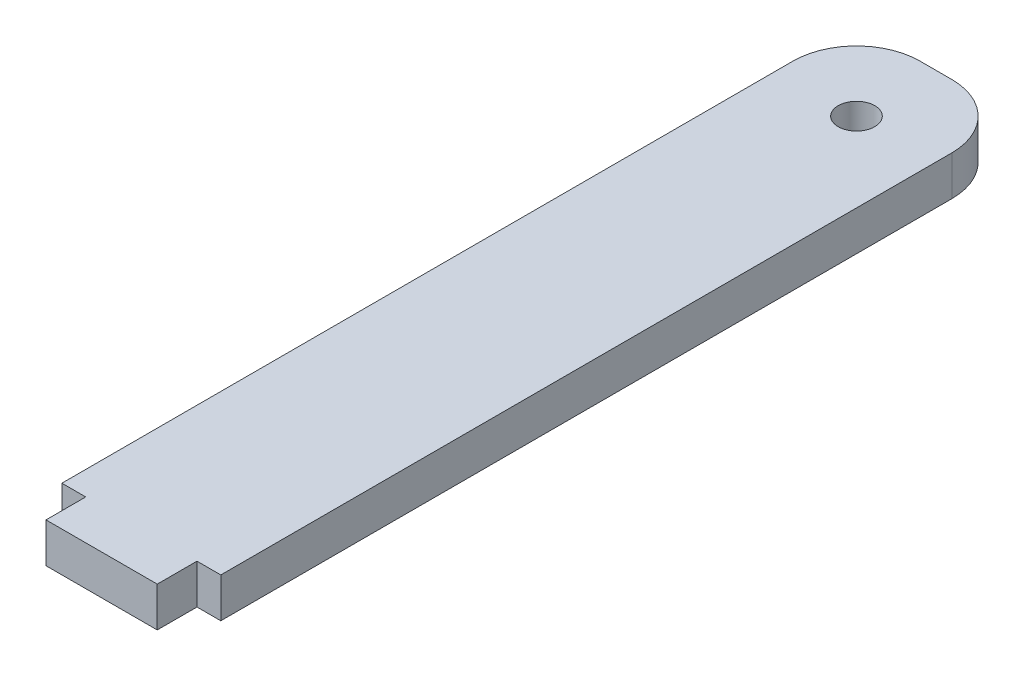
ISO-10303-21;
HEADER;
FILE_DESCRIPTION(('STEP AP214'),'2;1');
FILE_NAME('part.step','',(''),(''),'','','');
FILE_SCHEMA(('AUTOMOTIVE_DESIGN { 1 0 10303 214 1 1 1 1 }'));
ENDSEC;
DATA;
#1=APPLICATION_CONTEXT('core data for automotive mechanical design processes');
#2=APPLICATION_PROTOCOL_DEFINITION('international standard','automotive_design',2000,#1);
#3=PRODUCT_CONTEXT('',#1,'mechanical');
#4=PRODUCT('Part','Part','',(#3));
#5=PRODUCT_RELATED_PRODUCT_CATEGORY('part','',(#4));
#6=PRODUCT_DEFINITION_FORMATION('','',#4);
#7=PRODUCT_DEFINITION_CONTEXT('part definition',#1,'design');
#8=PRODUCT_DEFINITION('design','',#6,#7);
#9=PRODUCT_DEFINITION_SHAPE('','',#8);
#10=(LENGTH_UNIT() NAMED_UNIT(*) SI_UNIT(.MILLI.,.METRE.));
#11=(NAMED_UNIT(*) PLANE_ANGLE_UNIT() SI_UNIT($,.RADIAN.));
#12=(NAMED_UNIT(*) SI_UNIT($,.STERADIAN.) SOLID_ANGLE_UNIT());
#13=UNCERTAINTY_MEASURE_WITH_UNIT(LENGTH_MEASURE(1.E-05),#10,'distance_accuracy_value','');
#14=(GEOMETRIC_REPRESENTATION_CONTEXT(3) GLOBAL_UNCERTAINTY_ASSIGNED_CONTEXT((#13)) GLOBAL_UNIT_ASSIGNED_CONTEXT((#10,
#11,#12)) REPRESENTATION_CONTEXT('',''));
#15=CARTESIAN_POINT('',(0.,0.,0.));
#16=DIRECTION('',(0.,0.,1.));
#17=DIRECTION('',(1.,0.,0.));
#18=AXIS2_PLACEMENT_3D('',#15,#16,#17);
#19=CARTESIAN_POINT('',(0.,1.5875,-31.75));
#20=DIRECTION('',(0.,0.,1.));
#21=DIRECTION('',(1.,0.,0.));
#22=AXIS2_PLACEMENT_3D('',#19,#20,#21);
#23=PLANE('',#22);
#24=DIRECTION('',(-1.,0.,0.));
#25=VECTOR('',#24,1.);
#26=CARTESIAN_POINT('',(0.,1.5875,-31.75));
#27=LINE('',#26,#25);
#28=CARTESIAN_POINT('',(1.27,1.5875,-31.75));
#29=VERTEX_POINT('',#28);
#30=CARTESIAN_POINT('',(-1.27,1.5875,-31.75));
#31=VERTEX_POINT('',#30);
#32=EDGE_CURVE('E119',#29,#31,#27,.T.);
#33=ORIENTED_EDGE('',*,*,#32,.F.);
#34=DIRECTION('',(0.,-1.,0.));
#35=VECTOR('',#34,1.);
#36=CARTESIAN_POINT('',(1.27,-1.5875,-31.75));
#37=LINE('',#36,#35);
#38=CARTESIAN_POINT('',(1.27,-1.5875,-31.75));
#39=VERTEX_POINT('',#38);
#40=EDGE_CURVE('E184',#29,#39,#37,.T.);
#41=ORIENTED_EDGE('',*,*,#40,.T.);
#42=DIRECTION('',(-1.,0.,0.));
#43=VECTOR('',#42,1.);
#44=CARTESIAN_POINT('',(0.,-1.5875,-31.75));
#45=LINE('',#44,#43);
#46=CARTESIAN_POINT('',(-1.27,-1.5875,-31.75));
#47=VERTEX_POINT('',#46);
#48=EDGE_CURVE('E155',#39,#47,#45,.T.);
#49=ORIENTED_EDGE('',*,*,#48,.T.);
#50=DIRECTION('',(0.,-1.,0.));
#51=VECTOR('',#50,1.);
#52=CARTESIAN_POINT('',(-1.27,1.5875,-31.75));
#53=LINE('',#52,#51);
#54=EDGE_CURVE('E129',#47,#31,#53,.F.);
#55=ORIENTED_EDGE('',*,*,#54,.T.);
#56=EDGE_LOOP('',(#33,#41,#49,#55));
#57=FACE_BOUND('',#56,.T.);
#58=ADVANCED_FACE('F35',(#57),#23,.F.);
#59=CARTESIAN_POINT('',(-6.35,1.5875,0.));
#60=DIRECTION('',(1.,0.,0.));
#61=DIRECTION('',(0.,0.,-1.));
#62=AXIS2_PLACEMENT_3D('',#59,#60,#61);
#63=PLANE('',#62);
#64=DIRECTION('',(0.,0.,1.));
#65=VECTOR('',#64,1.);
#66=CARTESIAN_POINT('',(-6.35,1.5875,0.));
#67=LINE('',#66,#65);
#68=CARTESIAN_POINT('',(-6.35,1.5875,-26.67));
#69=VERTEX_POINT('',#68);
#70=CARTESIAN_POINT('',(-6.34999999999999,1.5875,31.75));
#71=VERTEX_POINT('',#70);
#72=EDGE_CURVE('E112',#69,#71,#67,.T.);
#73=ORIENTED_EDGE('',*,*,#72,.F.);
#74=DIRECTION('',(0.,-1.,0.));
#75=VECTOR('',#74,1.);
#76=CARTESIAN_POINT('',(-6.35,1.5875,-26.67));
#77=LINE('',#76,#75);
#78=CARTESIAN_POINT('',(-6.35,-1.5875,-26.67));
#79=VERTEX_POINT('',#78);
#80=EDGE_CURVE('E11',#69,#79,#77,.T.);
#81=ORIENTED_EDGE('',*,*,#80,.T.);
#82=DIRECTION('',(0.,0.,1.));
#83=VECTOR('',#82,1.);
#84=CARTESIAN_POINT('',(-6.35,-1.5875,0.));
#85=LINE('',#84,#83);
#86=CARTESIAN_POINT('',(-6.34999999999999,-1.5875,31.75));
#87=VERTEX_POINT('',#86);
#88=EDGE_CURVE('E125',#79,#87,#85,.T.);
#89=ORIENTED_EDGE('',*,*,#88,.T.);
#90=DIRECTION('',(0.,-1.,0.));
#91=VECTOR('',#90,1.);
#92=CARTESIAN_POINT('',(-6.34999999999999,1.5875,31.75));
#93=LINE('',#92,#91);
#94=EDGE_CURVE('E122',#71,#87,#93,.T.);
#95=ORIENTED_EDGE('',*,*,#94,.F.);
#96=EDGE_LOOP('',(#73,#81,#89,#95));
#97=FACE_BOUND('',#96,.T.);
#98=ADVANCED_FACE('F123',(#97),#63,.F.);
#99=CARTESIAN_POINT('',(0.,1.5875,31.75));
#100=DIRECTION('',(0.,0.,1.));
#101=DIRECTION('',(1.,0.,0.));
#102=AXIS2_PLACEMENT_3D('',#99,#100,#101);
#103=PLANE('',#102);
#104=DIRECTION('',(-1.,0.,0.));
#105=VECTOR('',#104,1.);
#106=CARTESIAN_POINT('',(0.,-1.5875,31.75));
#107=LINE('',#106,#105);
#108=CARTESIAN_POINT('',(-4.44499999999999,-1.5875,31.75));
#109=VERTEX_POINT('',#108);
#110=EDGE_CURVE('E159',#109,#87,#107,.T.);
#111=ORIENTED_EDGE('',*,*,#110,.F.);
#112=DIRECTION('',(0.,-1.,0.));
#113=VECTOR('',#112,1.);
#114=CARTESIAN_POINT('',(-4.44499999999999,1.5875,31.75));
#115=LINE('',#114,#113);
#116=CARTESIAN_POINT('',(-4.44499999999999,1.5875,31.75));
#117=VERTEX_POINT('',#116);
#118=EDGE_CURVE('E130',#117,#109,#115,.T.);
#119=ORIENTED_EDGE('',*,*,#118,.F.);
#120=DIRECTION('',(-1.,0.,0.));
#121=VECTOR('',#120,1.);
#122=CARTESIAN_POINT('',(0.,1.5875,31.75));
#123=LINE('',#122,#121);
#124=EDGE_CURVE('E116',#117,#71,#123,.T.);
#125=ORIENTED_EDGE('',*,*,#124,.T.);
#126=ORIENTED_EDGE('',*,*,#94,.T.);
#127=EDGE_LOOP('',(#111,#119,#125,#126));
#128=FACE_BOUND('',#127,.T.);
#129=ADVANCED_FACE('F132',(#128),#103,.T.);
#130=CARTESIAN_POINT('',(-4.44499999999999,1.5875,0.));
#131=DIRECTION('',(1.,0.,0.));
#132=DIRECTION('',(0.,0.,-1.));
#133=AXIS2_PLACEMENT_3D('',#130,#131,#132);
#134=PLANE('',#133);
#135=DIRECTION('',(0.,0.,1.));
#136=VECTOR('',#135,1.);
#137=CARTESIAN_POINT('',(-4.44499999999999,-1.5875,0.));
#138=LINE('',#137,#136);
#139=CARTESIAN_POINT('',(-4.44499999999999,-1.5875,34.925));
#140=VERTEX_POINT('',#139);
#141=EDGE_CURVE('E161',#109,#140,#138,.T.);
#142=ORIENTED_EDGE('',*,*,#141,.T.);
#143=DIRECTION('',(0.,-1.,0.));
#144=VECTOR('',#143,1.);
#145=CARTESIAN_POINT('',(-4.44499999999999,1.5875,34.925));
#146=LINE('',#145,#144);
#147=CARTESIAN_POINT('',(-4.44499999999999,1.5875,34.925));
#148=VERTEX_POINT('',#147);
#149=EDGE_CURVE('E179',#148,#140,#146,.T.);
#150=ORIENTED_EDGE('',*,*,#149,.F.);
#151=DIRECTION('',(0.,0.,1.));
#152=VECTOR('',#151,1.);
#153=CARTESIAN_POINT('',(-4.44499999999999,1.5875,0.));
#154=LINE('',#153,#152);
#155=EDGE_CURVE('E134',#117,#148,#154,.T.);
#156=ORIENTED_EDGE('',*,*,#155,.F.);
#157=ORIENTED_EDGE('',*,*,#118,.T.);
#158=EDGE_LOOP('',(#142,#150,#156,#157));
#159=FACE_BOUND('',#158,.T.);
#160=ADVANCED_FACE('F218',(#159),#134,.F.);
#161=CARTESIAN_POINT('',(0.,1.5875,34.925));
#162=DIRECTION('',(0.,0.,-1.));
#163=DIRECTION('',(-1.,0.,0.));
#164=AXIS2_PLACEMENT_3D('',#161,#162,#163);
#165=PLANE('',#164);
#166=DIRECTION('',(1.,0.,0.));
#167=VECTOR('',#166,1.);
#168=CARTESIAN_POINT('',(0.,-1.5875,34.925));
#169=LINE('',#168,#167);
#170=CARTESIAN_POINT('',(4.445,-1.5875,34.925));
#171=VERTEX_POINT('',#170);
#172=EDGE_CURVE('E164',#140,#171,#169,.T.);
#173=ORIENTED_EDGE('',*,*,#172,.T.);
#174=DIRECTION('',(0.,-1.,0.));
#175=VECTOR('',#174,1.);
#176=CARTESIAN_POINT('',(4.445,1.5875,34.925));
#177=LINE('',#176,#175);
#178=CARTESIAN_POINT('',(4.445,1.5875,34.925));
#179=VERTEX_POINT('',#178);
#180=EDGE_CURVE('E176',#179,#171,#177,.T.);
#181=ORIENTED_EDGE('',*,*,#180,.F.);
#182=DIRECTION('',(1.,0.,0.));
#183=VECTOR('',#182,1.);
#184=CARTESIAN_POINT('',(0.,1.5875,34.925));
#185=LINE('',#184,#183);
#186=EDGE_CURVE('E137',#148,#179,#185,.T.);
#187=ORIENTED_EDGE('',*,*,#186,.F.);
#188=ORIENTED_EDGE('',*,*,#149,.T.);
#189=EDGE_LOOP('',(#173,#181,#187,#188));
#190=FACE_BOUND('',#189,.T.);
#191=ADVANCED_FACE('F215',(#190),#165,.F.);
#192=CARTESIAN_POINT('',(4.445,1.5875,0.));
#193=DIRECTION('',(-1.,0.,0.));
#194=DIRECTION('',(0.,0.,1.));
#195=AXIS2_PLACEMENT_3D('',#192,#193,#194);
#196=PLANE('',#195);
#197=DIRECTION('',(0.,0.,-1.));
#198=VECTOR('',#197,1.);
#199=CARTESIAN_POINT('',(4.445,-1.5875,0.));
#200=LINE('',#199,#198);
#201=CARTESIAN_POINT('',(4.445,-1.5875,31.75));
#202=VERTEX_POINT('',#201);
#203=EDGE_CURVE('E166',#171,#202,#200,.T.);
#204=ORIENTED_EDGE('',*,*,#203,.T.);
#205=DIRECTION('',(0.,-1.,0.));
#206=VECTOR('',#205,1.);
#207=CARTESIAN_POINT('',(4.445,1.5875,31.75));
#208=LINE('',#207,#206);
#209=CARTESIAN_POINT('',(4.445,1.5875,31.75));
#210=VERTEX_POINT('',#209);
#211=EDGE_CURVE('E174',#210,#202,#208,.T.);
#212=ORIENTED_EDGE('',*,*,#211,.F.);
#213=DIRECTION('',(0.,0.,-1.));
#214=VECTOR('',#213,1.);
#215=CARTESIAN_POINT('',(4.445,1.5875,0.));
#216=LINE('',#215,#214);
#217=EDGE_CURVE('E141',#179,#210,#216,.T.);
#218=ORIENTED_EDGE('',*,*,#217,.F.);
#219=ORIENTED_EDGE('',*,*,#180,.T.);
#220=EDGE_LOOP('',(#204,#212,#218,#219));
#221=FACE_BOUND('',#220,.T.);
#222=ADVANCED_FACE('F211',(#221),#196,.F.);
#223=CARTESIAN_POINT('',(6.35,-1.5875,31.75));
#224=VERTEX_POINT('',#223);
#225=EDGE_CURVE('E162',#224,#202,#107,.T.);
#226=ORIENTED_EDGE('',*,*,#225,.F.);
#227=DIRECTION('',(0.,-1.,0.));
#228=VECTOR('',#227,1.);
#229=CARTESIAN_POINT('',(6.35,1.5875,31.75));
#230=LINE('',#229,#228);
#231=CARTESIAN_POINT('',(6.35,1.5875,31.75));
#232=VERTEX_POINT('',#231);
#233=EDGE_CURVE('E145',#232,#224,#230,.T.);
#234=ORIENTED_EDGE('',*,*,#233,.F.);
#235=EDGE_CURVE('E136',#232,#210,#123,.T.);
#236=ORIENTED_EDGE('',*,*,#235,.T.);
#237=ORIENTED_EDGE('',*,*,#211,.T.);
#238=EDGE_LOOP('',(#226,#234,#236,#237));
#239=FACE_BOUND('',#238,.T.);
#240=ADVANCED_FACE('F206',(#239),#103,.T.);
#241=CARTESIAN_POINT('',(0.,1.5875,-25.4));
#242=DIRECTION('',(0.,-1.,0.));
#243=DIRECTION('',(0.,0.,-1.));
#244=AXIS2_PLACEMENT_3D('',#241,#242,#243);
#245=CYLINDRICAL_SURFACE('',#244,1.4605);
#246=CARTESIAN_POINT('',(0.,1.5875,-25.4));
#247=DIRECTION('',(0.,1.,0.));
#248=DIRECTION('',(0.,0.,1.));
#249=AXIS2_PLACEMENT_3D('',#246,#247,#248);
#250=CIRCLE('',#249,1.4605);
#251=CARTESIAN_POINT('',(0.,1.5875,-23.9395));
#252=VERTEX_POINT('',#251);
#253=EDGE_CURVE('E171',#252,#252,#250,.T.);
#254=ORIENTED_EDGE('',*,*,#253,.T.);
#255=EDGE_LOOP('',(#254));
#256=FACE_BOUND('',#255,.T.);
#257=CARTESIAN_POINT('',(0.,-1.5875,-25.4));
#258=DIRECTION('',(0.,1.,0.));
#259=DIRECTION('',(0.,0.,1.));
#260=AXIS2_PLACEMENT_3D('',#257,#258,#259);
#261=CIRCLE('',#260,1.4605);
#262=CARTESIAN_POINT('',(0.,-1.5875,-23.9395));
#263=VERTEX_POINT('',#262);
#264=EDGE_CURVE('E152',#263,#263,#261,.T.);
#265=ORIENTED_EDGE('',*,*,#264,.F.);
#266=EDGE_LOOP('',(#265));
#267=FACE_BOUND('',#266,.T.);
#268=ADVANCED_FACE('F232',(#256,#267),#245,.F.);
#269=CARTESIAN_POINT('',(6.35,1.5875,0.));
#270=DIRECTION('',(1.,0.,0.));
#271=DIRECTION('',(0.,0.,-1.));
#272=AXIS2_PLACEMENT_3D('',#269,#270,#271);
#273=PLANE('',#272);
#274=DIRECTION('',(0.,0.,1.));
#275=VECTOR('',#274,1.);
#276=CARTESIAN_POINT('',(6.35,-1.5875,0.));
#277=LINE('',#276,#275);
#278=CARTESIAN_POINT('',(6.35,-1.5875,-26.67));
#279=VERTEX_POINT('',#278);
#280=EDGE_CURVE('E169',#279,#224,#277,.T.);
#281=ORIENTED_EDGE('',*,*,#280,.F.);
#282=DIRECTION('',(0.,-1.,0.));
#283=VECTOR('',#282,1.);
#284=CARTESIAN_POINT('',(6.35,1.5875,-26.67));
#285=LINE('',#284,#283);
#286=CARTESIAN_POINT('',(6.35,1.5875,-26.67));
#287=VERTEX_POINT('',#286);
#288=EDGE_CURVE('E58',#279,#287,#285,.F.);
#289=ORIENTED_EDGE('',*,*,#288,.T.);
#290=DIRECTION('',(0.,0.,1.));
#291=VECTOR('',#290,1.);
#292=CARTESIAN_POINT('',(6.35,1.5875,0.));
#293=LINE('',#292,#291);
#294=EDGE_CURVE('E140',#287,#232,#293,.T.);
#295=ORIENTED_EDGE('',*,*,#294,.T.);
#296=ORIENTED_EDGE('',*,*,#233,.T.);
#297=EDGE_LOOP('',(#281,#289,#295,#296));
#298=FACE_BOUND('',#297,.T.);
#299=ADVANCED_FACE('F204',(#298),#273,.T.);
#300=CARTESIAN_POINT('',(0.,1.5875,0.));
#301=DIRECTION('',(0.,1.,0.));
#302=DIRECTION('',(0.,0.,1.));
#303=AXIS2_PLACEMENT_3D('',#300,#301,#302);
#304=PLANE('',#303);
#305=ORIENTED_EDGE('',*,*,#253,.F.);
#306=EDGE_LOOP('',(#305));
#307=FACE_BOUND('',#306,.T.);
#308=ORIENTED_EDGE('',*,*,#294,.F.);
#309=CARTESIAN_POINT('',(1.27,1.5875,-26.67));
#310=DIRECTION('',(0.,1.,0.));
#311=DIRECTION('',(0.,0.,1.));
#312=AXIS2_PLACEMENT_3D('',#309,#310,#311);
#313=CIRCLE('',#312,5.08);
#314=EDGE_CURVE('E43',#287,#29,#313,.T.);
#315=ORIENTED_EDGE('',*,*,#314,.T.);
#316=ORIENTED_EDGE('',*,*,#32,.T.);
#317=CARTESIAN_POINT('',(-1.27,1.5875,-26.67));
#318=DIRECTION('',(0.,1.,0.));
#319=DIRECTION('',(0.,0.,1.));
#320=AXIS2_PLACEMENT_3D('',#317,#318,#319);
#321=CIRCLE('',#320,5.08);
#322=EDGE_CURVE('E50',#31,#69,#321,.T.);
#323=ORIENTED_EDGE('',*,*,#322,.T.);
#324=ORIENTED_EDGE('',*,*,#72,.T.);
#325=ORIENTED_EDGE('',*,*,#124,.F.);
#326=ORIENTED_EDGE('',*,*,#155,.T.);
#327=ORIENTED_EDGE('',*,*,#186,.T.);
#328=ORIENTED_EDGE('',*,*,#217,.T.);
#329=ORIENTED_EDGE('',*,*,#235,.F.);
#330=EDGE_LOOP('',(#308,#315,#316,#323,#324,#325,#326,#327,#328,#329));
#331=FACE_BOUND('',#330,.T.);
#332=ADVANCED_FACE('F114',(#307,#331),#304,.T.);
#333=CARTESIAN_POINT('',(0.,-1.5875,0.));
#334=DIRECTION('',(0.,1.,0.));
#335=DIRECTION('',(0.,0.,1.));
#336=AXIS2_PLACEMENT_3D('',#333,#334,#335);
#337=PLANE('',#336);
#338=ORIENTED_EDGE('',*,*,#264,.T.);
#339=EDGE_LOOP('',(#338));
#340=FACE_BOUND('',#339,.T.);
#341=ORIENTED_EDGE('',*,*,#48,.F.);
#342=CARTESIAN_POINT('',(1.27,-1.5875,-26.67));
#343=DIRECTION('',(0.,1.,0.));
#344=DIRECTION('',(0.,0.,1.));
#345=AXIS2_PLACEMENT_3D('',#342,#343,#344);
#346=CIRCLE('',#345,5.08);
#347=EDGE_CURVE('E189',#39,#279,#346,.F.);
#348=ORIENTED_EDGE('',*,*,#347,.T.);
#349=ORIENTED_EDGE('',*,*,#280,.T.);
#350=ORIENTED_EDGE('',*,*,#225,.T.);
#351=ORIENTED_EDGE('',*,*,#203,.F.);
#352=ORIENTED_EDGE('',*,*,#172,.F.);
#353=ORIENTED_EDGE('',*,*,#141,.F.);
#354=ORIENTED_EDGE('',*,*,#110,.T.);
#355=ORIENTED_EDGE('',*,*,#88,.F.);
#356=CARTESIAN_POINT('',(-1.27,-1.5875,-26.67));
#357=DIRECTION('',(0.,1.,0.));
#358=DIRECTION('',(0.,0.,1.));
#359=AXIS2_PLACEMENT_3D('',#356,#357,#358);
#360=CIRCLE('',#359,5.08);
#361=EDGE_CURVE('E187',#79,#47,#360,.F.);
#362=ORIENTED_EDGE('',*,*,#361,.T.);
#363=EDGE_LOOP('',(#341,#348,#349,#350,#351,#352,#353,#354,#355,#362));
#364=FACE_BOUND('',#363,.T.);
#365=ADVANCED_FACE('F202',(#340,#364),#337,.F.);
#366=CARTESIAN_POINT('',(1.27,1.5875,-26.67));
#367=DIRECTION('',(0.,1.,0.));
#368=DIRECTION('',(0.,0.,1.));
#369=AXIS2_PLACEMENT_3D('',#366,#367,#368);
#370=CYLINDRICAL_SURFACE('',#369,5.08);
#371=ORIENTED_EDGE('',*,*,#314,.F.);
#372=ORIENTED_EDGE('',*,*,#288,.F.);
#373=ORIENTED_EDGE('',*,*,#347,.F.);
#374=ORIENTED_EDGE('',*,*,#40,.F.);
#375=EDGE_LOOP('',(#371,#372,#373,#374));
#376=FACE_BOUND('',#375,.T.);
#377=ADVANCED_FACE('F200',(#376),#370,.T.);
#378=CARTESIAN_POINT('',(-1.27,1.5875,-26.67));
#379=DIRECTION('',(0.,-1.,0.));
#380=DIRECTION('',(0.,0.,-1.));
#381=AXIS2_PLACEMENT_3D('',#378,#379,#380);
#382=CYLINDRICAL_SURFACE('',#381,5.08);
#383=ORIENTED_EDGE('',*,*,#322,.F.);
#384=ORIENTED_EDGE('',*,*,#54,.F.);
#385=ORIENTED_EDGE('',*,*,#361,.F.);
#386=ORIENTED_EDGE('',*,*,#80,.F.);
#387=EDGE_LOOP('',(#383,#384,#385,#386));
#388=FACE_BOUND('',#387,.T.);
#389=ADVANCED_FACE('F37',(#388),#382,.T.);
#390=CLOSED_SHELL('',(#58,#98,#129,#160,#191,#222,#240,#268,#299,#332,#365,#377,#389));
#391=MANIFOLD_SOLID_BREP('B2',#390);
#392=ADVANCED_BREP_SHAPE_REPRESENTATION('',(#18,#391),#14);
#393=SHAPE_DEFINITION_REPRESENTATION(#9,#392);
ENDSEC;
END-ISO-10303-21;
